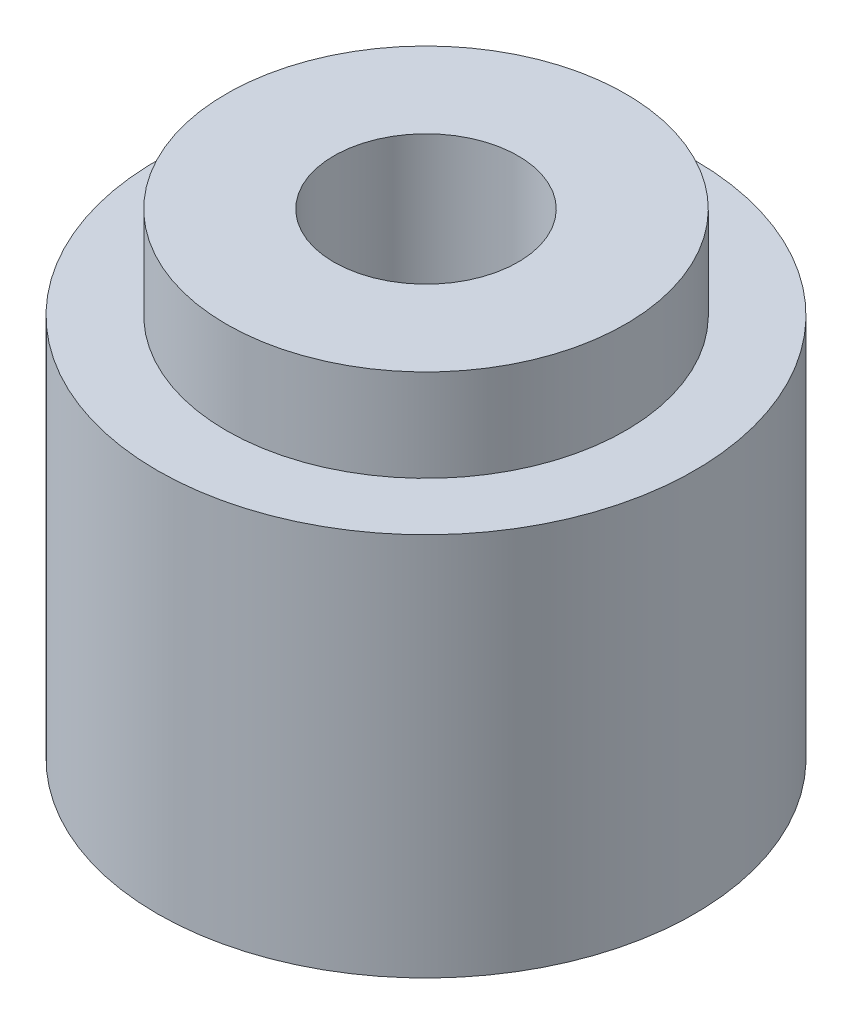
ISO-10303-21;
HEADER;
FILE_DESCRIPTION(('STEP AP214'),'2;1');
FILE_NAME('part.step','',(''),(''),'','','');
FILE_SCHEMA(('AUTOMOTIVE_DESIGN { 1 0 10303 214 1 1 1 1 }'));
ENDSEC;
DATA;
#1=APPLICATION_CONTEXT('core data for automotive mechanical design processes');
#2=APPLICATION_PROTOCOL_DEFINITION('international standard','automotive_design',2000,#1);
#3=PRODUCT_CONTEXT('',#1,'mechanical');
#4=PRODUCT('Part','Part','',(#3));
#5=PRODUCT_RELATED_PRODUCT_CATEGORY('part','',(#4));
#6=PRODUCT_DEFINITION_FORMATION('','',#4);
#7=PRODUCT_DEFINITION_CONTEXT('part definition',#1,'design');
#8=PRODUCT_DEFINITION('design','',#6,#7);
#9=PRODUCT_DEFINITION_SHAPE('','',#8);
#10=(LENGTH_UNIT() NAMED_UNIT(*) SI_UNIT(.MILLI.,.METRE.));
#11=(NAMED_UNIT(*) PLANE_ANGLE_UNIT() SI_UNIT($,.RADIAN.));
#12=(NAMED_UNIT(*) SI_UNIT($,.STERADIAN.) SOLID_ANGLE_UNIT());
#13=UNCERTAINTY_MEASURE_WITH_UNIT(LENGTH_MEASURE(1.E-05),#10,'distance_accuracy_value','');
#14=(GEOMETRIC_REPRESENTATION_CONTEXT(3) GLOBAL_UNCERTAINTY_ASSIGNED_CONTEXT((#13)) GLOBAL_UNIT_ASSIGNED_CONTEXT((#10,
#11,#12)) REPRESENTATION_CONTEXT('',''));
#15=CARTESIAN_POINT('',(0.,0.,0.));
#16=DIRECTION('',(0.,0.,1.));
#17=DIRECTION('',(1.,0.,0.));
#18=AXIS2_PLACEMENT_3D('',#15,#16,#17);
#19=CARTESIAN_POINT('',(0.,25.,0.));
#20=DIRECTION('',(0.,-1.,0.));
#21=DIRECTION('',(0.,0.,-1.));
#22=AXIS2_PLACEMENT_3D('',#19,#20,#21);
#23=CYLINDRICAL_SURFACE('',#22,17.5);
#24=CARTESIAN_POINT('',(0.,25.,0.));
#25=DIRECTION('',(0.,1.,0.));
#26=DIRECTION('',(0.,0.,1.));
#27=AXIS2_PLACEMENT_3D('',#24,#25,#26);
#28=CIRCLE('',#27,17.5);
#29=CARTESIAN_POINT('',(0.,25.,17.5));
#30=VERTEX_POINT('',#29);
#31=EDGE_CURVE('E37',#30,#30,#28,.T.);
#32=ORIENTED_EDGE('',*,*,#31,.F.);
#33=EDGE_LOOP('',(#32));
#34=FACE_BOUND('',#33,.T.);
#35=CARTESIAN_POINT('',(0.,0.,0.));
#36=DIRECTION('',(0.,1.,0.));
#37=DIRECTION('',(0.,0.,1.));
#38=AXIS2_PLACEMENT_3D('',#35,#36,#37);
#39=CIRCLE('',#38,17.5);
#40=CARTESIAN_POINT('',(0.,0.,17.5));
#41=VERTEX_POINT('',#40);
#42=EDGE_CURVE('E33',#41,#41,#39,.T.);
#43=ORIENTED_EDGE('',*,*,#42,.T.);
#44=EDGE_LOOP('',(#43));
#45=FACE_BOUND('',#44,.T.);
#46=ADVANCED_FACE('F30',(#34,#45),#23,.T.);
#47=CARTESIAN_POINT('',(0.,25.,0.));
#48=DIRECTION('',(0.,1.,0.));
#49=DIRECTION('',(0.,0.,1.));
#50=AXIS2_PLACEMENT_3D('',#47,#48,#49);
#51=PLANE('',#50);
#52=CARTESIAN_POINT('',(0.,25.,0.));
#53=DIRECTION('',(0.,1.,0.));
#54=DIRECTION('',(0.,0.,1.));
#55=AXIS2_PLACEMENT_3D('',#52,#53,#54);
#56=CIRCLE('',#55,13.);
#57=CARTESIAN_POINT('',(0.,25.,13.));
#58=VERTEX_POINT('',#57);
#59=EDGE_CURVE('E10',#58,#58,#56,.T.);
#60=ORIENTED_EDGE('',*,*,#59,.F.);
#61=EDGE_LOOP('',(#60));
#62=FACE_BOUND('',#61,.T.);
#63=ORIENTED_EDGE('',*,*,#31,.T.);
#64=EDGE_LOOP('',(#63));
#65=FACE_BOUND('',#64,.T.);
#66=ADVANCED_FACE('F74',(#62,#65),#51,.T.);
#67=CARTESIAN_POINT('',(0.,0.,0.));
#68=DIRECTION('',(0.,1.,0.));
#69=DIRECTION('',(0.,0.,1.));
#70=AXIS2_PLACEMENT_3D('',#67,#68,#69);
#71=PLANE('',#70);
#72=CARTESIAN_POINT('',(0.,0.,0.));
#73=DIRECTION('',(0.,1.,0.));
#74=DIRECTION('',(0.,0.,1.));
#75=AXIS2_PLACEMENT_3D('',#72,#73,#74);
#76=CIRCLE('',#75,6.);
#77=CARTESIAN_POINT('',(0.,0.,6.));
#78=VERTEX_POINT('',#77);
#79=EDGE_CURVE('E46',#78,#78,#76,.T.);
#80=ORIENTED_EDGE('',*,*,#79,.T.);
#81=EDGE_LOOP('',(#80));
#82=FACE_BOUND('',#81,.T.);
#83=ORIENTED_EDGE('',*,*,#42,.F.);
#84=EDGE_LOOP('',(#83));
#85=FACE_BOUND('',#84,.T.);
#86=ADVANCED_FACE('F53',(#82,#85),#71,.F.);
#87=CARTESIAN_POINT('',(0.,31.,0.));
#88=DIRECTION('',(0.,-1.,0.));
#89=DIRECTION('',(0.,0.,-1.));
#90=AXIS2_PLACEMENT_3D('',#87,#88,#89);
#91=CYLINDRICAL_SURFACE('',#90,13.);
#92=CARTESIAN_POINT('',(0.,31.,0.));
#93=DIRECTION('',(0.,1.,0.));
#94=DIRECTION('',(0.,0.,1.));
#95=AXIS2_PLACEMENT_3D('',#92,#93,#94);
#96=CIRCLE('',#95,13.);
#97=CARTESIAN_POINT('',(0.,31.,13.));
#98=VERTEX_POINT('',#97);
#99=EDGE_CURVE('E43',#98,#98,#96,.T.);
#100=ORIENTED_EDGE('',*,*,#99,.F.);
#101=EDGE_LOOP('',(#100));
#102=FACE_BOUND('',#101,.T.);
#103=ORIENTED_EDGE('',*,*,#59,.T.);
#104=EDGE_LOOP('',(#103));
#105=FACE_BOUND('',#104,.T.);
#106=ADVANCED_FACE('F65',(#102,#105),#91,.T.);
#107=CARTESIAN_POINT('',(0.,31.,0.));
#108=DIRECTION('',(0.,1.,0.));
#109=DIRECTION('',(0.,0.,1.));
#110=AXIS2_PLACEMENT_3D('',#107,#108,#109);
#111=PLANE('',#110);
#112=CARTESIAN_POINT('',(0.,31.,0.));
#113=DIRECTION('',(0.,1.,0.));
#114=DIRECTION('',(0.,0.,1.));
#115=AXIS2_PLACEMENT_3D('',#112,#113,#114);
#116=CIRCLE('',#115,6.);
#117=CARTESIAN_POINT('',(0.,31.,6.));
#118=VERTEX_POINT('',#117);
#119=EDGE_CURVE('E47',#118,#118,#116,.T.);
#120=ORIENTED_EDGE('',*,*,#119,.F.);
#121=EDGE_LOOP('',(#120));
#122=FACE_BOUND('',#121,.T.);
#123=ORIENTED_EDGE('',*,*,#99,.T.);
#124=EDGE_LOOP('',(#123));
#125=FACE_BOUND('',#124,.T.);
#126=ADVANCED_FACE('F59',(#122,#125),#111,.T.);
#127=CARTESIAN_POINT('',(0.,0.,0.));
#128=DIRECTION('',(0.,1.,0.));
#129=DIRECTION('',(0.,0.,1.));
#130=AXIS2_PLACEMENT_3D('',#127,#128,#129);
#131=CYLINDRICAL_SURFACE('',#130,6.);
#132=ORIENTED_EDGE('',*,*,#79,.F.);
#133=EDGE_LOOP('',(#132));
#134=FACE_BOUND('',#133,.T.);
#135=ORIENTED_EDGE('',*,*,#119,.T.);
#136=EDGE_LOOP('',(#135));
#137=FACE_BOUND('',#136,.T.);
#138=ADVANCED_FACE('F56',(#134,#137),#131,.F.);
#139=CLOSED_SHELL('',(#46,#66,#86,#106,#126,#138));
#140=MANIFOLD_SOLID_BREP('B2',#139);
#141=ADVANCED_BREP_SHAPE_REPRESENTATION('',(#18,#140),#14);
#142=SHAPE_DEFINITION_REPRESENTATION(#9,#141);
ENDSEC;
END-ISO-10303-21;
